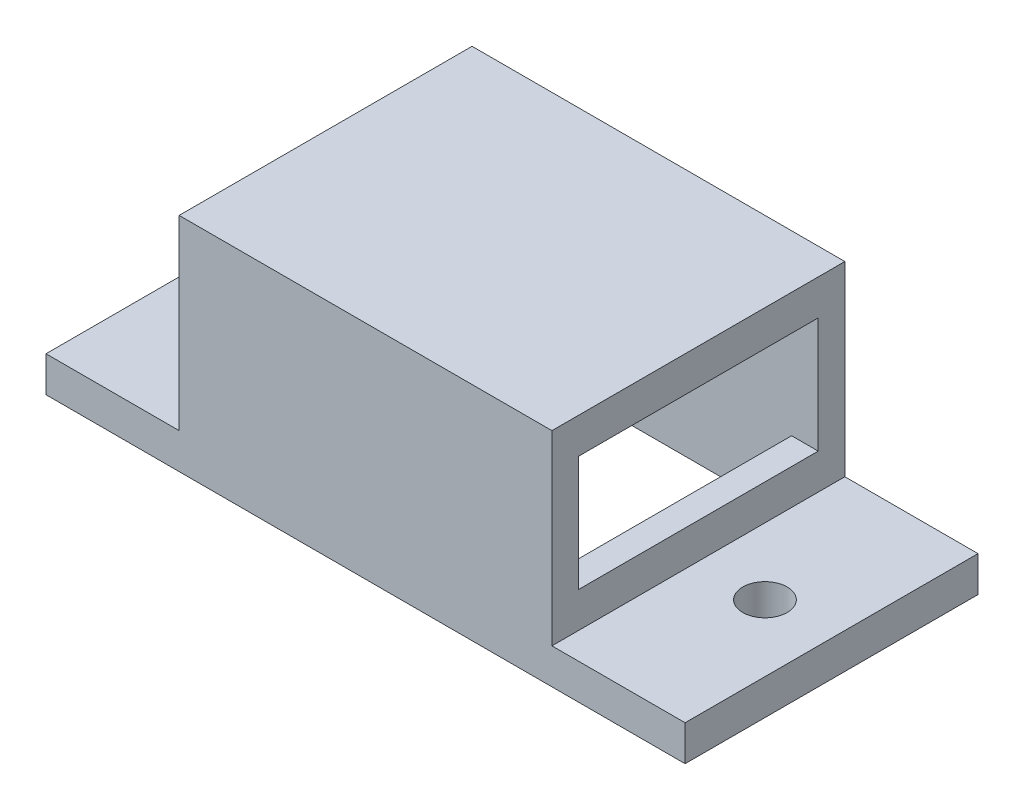
ISO-10303-21;
HEADER;
FILE_DESCRIPTION(('STEP AP214'),'2;1');
FILE_NAME('part.step','',(''),(''),'','','');
FILE_SCHEMA(('AUTOMOTIVE_DESIGN { 1 0 10303 214 1 1 1 1 }'));
ENDSEC;
DATA;
#1=APPLICATION_CONTEXT('core data for automotive mechanical design processes');
#2=APPLICATION_PROTOCOL_DEFINITION('international standard','automotive_design',2000,#1);
#3=PRODUCT_CONTEXT('',#1,'mechanical');
#4=PRODUCT('Part','Part','',(#3));
#5=PRODUCT_RELATED_PRODUCT_CATEGORY('part','',(#4));
#6=PRODUCT_DEFINITION_FORMATION('','',#4);
#7=PRODUCT_DEFINITION_CONTEXT('part definition',#1,'design');
#8=PRODUCT_DEFINITION('design','',#6,#7);
#9=PRODUCT_DEFINITION_SHAPE('','',#8);
#10=(LENGTH_UNIT() NAMED_UNIT(*) SI_UNIT(.MILLI.,.METRE.));
#11=(NAMED_UNIT(*) PLANE_ANGLE_UNIT() SI_UNIT($,.RADIAN.));
#12=(NAMED_UNIT(*) SI_UNIT($,.STERADIAN.) SOLID_ANGLE_UNIT());
#13=UNCERTAINTY_MEASURE_WITH_UNIT(LENGTH_MEASURE(1.E-05),#10,'distance_accuracy_value','');
#14=(GEOMETRIC_REPRESENTATION_CONTEXT(3) GLOBAL_UNCERTAINTY_ASSIGNED_CONTEXT((#13)) GLOBAL_UNIT_ASSIGNED_CONTEXT((#10,
#11,#12)) REPRESENTATION_CONTEXT('',''));
#15=CARTESIAN_POINT('',(0.,0.,0.));
#16=DIRECTION('',(0.,0.,1.));
#17=DIRECTION('',(1.,0.,0.));
#18=AXIS2_PLACEMENT_3D('',#15,#16,#17);
#19=CARTESIAN_POINT('',(0.,0.,0.));
#20=DIRECTION('',(0.,1.,0.));
#21=DIRECTION('',(0.,0.,1.));
#22=AXIS2_PLACEMENT_3D('',#19,#20,#21);
#23=PLANE('',#22);
#24=DIRECTION('',(-1.,0.,0.));
#25=VECTOR('',#24,1.);
#26=CARTESIAN_POINT('',(-21.,0.,-16.5));
#27=LINE('',#26,#25);
#28=CARTESIAN_POINT('',(36.,0.,-16.5));
#29=VERTEX_POINT('',#28);
#30=CARTESIAN_POINT('',(-36.,0.,-16.5));
#31=VERTEX_POINT('',#30);
#32=EDGE_CURVE('E250',#29,#31,#27,.T.);
#33=ORIENTED_EDGE('',*,*,#32,.F.);
#34=DIRECTION('',(0.,0.,-1.));
#35=VECTOR('',#34,1.);
#36=CARTESIAN_POINT('',(36.,0.,-16.5));
#37=LINE('',#36,#35);
#38=CARTESIAN_POINT('',(36.,0.,16.5));
#39=VERTEX_POINT('',#38);
#40=EDGE_CURVE('E211',#39,#29,#37,.T.);
#41=ORIENTED_EDGE('',*,*,#40,.F.);
#42=DIRECTION('',(1.,0.,0.));
#43=VECTOR('',#42,1.);
#44=CARTESIAN_POINT('',(-21.,0.,16.5));
#45=LINE('',#44,#43);
#46=CARTESIAN_POINT('',(-36.,0.,16.5));
#47=VERTEX_POINT('',#46);
#48=EDGE_CURVE('E255',#47,#39,#45,.T.);
#49=ORIENTED_EDGE('',*,*,#48,.F.);
#50=DIRECTION('',(0.,0.,1.));
#51=VECTOR('',#50,1.);
#52=CARTESIAN_POINT('',(-36.,0.,-16.5));
#53=LINE('',#52,#51);
#54=EDGE_CURVE('E220',#31,#47,#53,.T.);
#55=ORIENTED_EDGE('',*,*,#54,.F.);
#56=EDGE_LOOP('',(#33,#41,#49,#55));
#57=FACE_BOUND('',#56,.T.);
#58=DIRECTION('',(-1.,0.,0.));
#59=VECTOR('',#58,1.);
#60=CARTESIAN_POINT('',(-18.,0.,13.5));
#61=LINE('',#60,#59);
#62=CARTESIAN_POINT('',(18.,0.,13.5));
#63=VERTEX_POINT('',#62);
#64=CARTESIAN_POINT('',(-18.,0.,13.5));
#65=VERTEX_POINT('',#64);
#66=EDGE_CURVE('E202',#63,#65,#61,.T.);
#67=ORIENTED_EDGE('',*,*,#66,.F.);
#68=DIRECTION('',(0.,0.,1.));
#69=VECTOR('',#68,1.);
#70=CARTESIAN_POINT('',(18.,0.,13.5));
#71=LINE('',#70,#69);
#72=CARTESIAN_POINT('',(18.,0.,-13.5));
#73=VERTEX_POINT('',#72);
#74=EDGE_CURVE('E193',#73,#63,#71,.T.);
#75=ORIENTED_EDGE('',*,*,#74,.F.);
#76=DIRECTION('',(1.,0.,0.));
#77=VECTOR('',#76,1.);
#78=CARTESIAN_POINT('',(-18.,0.,-13.5));
#79=LINE('',#78,#77);
#80=CARTESIAN_POINT('',(-18.,0.,-13.5));
#81=VERTEX_POINT('',#80);
#82=EDGE_CURVE('E197',#81,#73,#79,.T.);
#83=ORIENTED_EDGE('',*,*,#82,.F.);
#84=DIRECTION('',(0.,0.,-1.));
#85=VECTOR('',#84,1.);
#86=CARTESIAN_POINT('',(-18.,0.,13.5));
#87=LINE('',#86,#85);
#88=EDGE_CURVE('E204',#65,#81,#87,.T.);
#89=ORIENTED_EDGE('',*,*,#88,.F.);
#90=EDGE_LOOP('',(#67,#75,#83,#89));
#91=FACE_BOUND('',#90,.T.);
#92=CARTESIAN_POINT('',(-28.5,0.,0.));
#93=DIRECTION('',(0.,1.,0.));
#94=DIRECTION('',(0.,0.,1.));
#95=AXIS2_PLACEMENT_3D('',#92,#93,#94);
#96=CIRCLE('',#95,2.5);
#97=CARTESIAN_POINT('',(-28.5,0.,2.5));
#98=VERTEX_POINT('',#97);
#99=EDGE_CURVE('E275',#98,#98,#96,.T.);
#100=ORIENTED_EDGE('',*,*,#99,.T.);
#101=EDGE_LOOP('',(#100));
#102=FACE_BOUND('',#101,.T.);
#103=CARTESIAN_POINT('',(28.5,0.,0.));
#104=DIRECTION('',(0.,-1.,0.));
#105=DIRECTION('',(0.,0.,-1.));
#106=AXIS2_PLACEMENT_3D('',#103,#104,#105);
#107=CIRCLE('',#106,2.5);
#108=CARTESIAN_POINT('',(28.5,0.,-2.5));
#109=VERTEX_POINT('',#108);
#110=EDGE_CURVE('E270',#109,#109,#107,.T.);
#111=ORIENTED_EDGE('',*,*,#110,.F.);
#112=EDGE_LOOP('',(#111));
#113=FACE_BOUND('',#112,.T.);
#114=ADVANCED_FACE('F33',(#57,#91,#102,#113),#23,.F.);
#115=CARTESIAN_POINT('',(21.,25.,-16.5));
#116=DIRECTION('',(-1.,0.,0.));
#117=DIRECTION('',(0.,0.,1.));
#118=AXIS2_PLACEMENT_3D('',#115,#116,#117);
#119=PLANE('',#118);
#120=DIRECTION('',(0.,0.,-1.));
#121=VECTOR('',#120,1.);
#122=CARTESIAN_POINT('',(21.,21.,-16.5));
#123=LINE('',#122,#121);
#124=CARTESIAN_POINT('',(21.,21.,13.5));
#125=VERTEX_POINT('',#124);
#126=CARTESIAN_POINT('',(21.,21.,-13.5));
#127=VERTEX_POINT('',#126);
#128=EDGE_CURVE('E190',#125,#127,#123,.T.);
#129=ORIENTED_EDGE('',*,*,#128,.T.);
#130=DIRECTION('',(0.,-1.,0.));
#131=VECTOR('',#130,1.);
#132=CARTESIAN_POINT('',(21.,25.,-13.5));
#133=LINE('',#132,#131);
#134=CARTESIAN_POINT('',(21.,8.,-13.5));
#135=VERTEX_POINT('',#134);
#136=EDGE_CURVE('E179',#127,#135,#133,.T.);
#137=ORIENTED_EDGE('',*,*,#136,.T.);
#138=DIRECTION('',(0.,0.,1.));
#139=VECTOR('',#138,1.);
#140=CARTESIAN_POINT('',(21.,8.,-16.5));
#141=LINE('',#140,#139);
#142=CARTESIAN_POINT('',(21.,8.,13.5));
#143=VERTEX_POINT('',#142);
#144=EDGE_CURVE('E187',#135,#143,#141,.T.);
#145=ORIENTED_EDGE('',*,*,#144,.T.);
#146=DIRECTION('',(0.,1.,0.));
#147=VECTOR('',#146,1.);
#148=CARTESIAN_POINT('',(21.,25.,13.5));
#149=LINE('',#148,#147);
#150=EDGE_CURVE('E176',#143,#125,#149,.T.);
#151=ORIENTED_EDGE('',*,*,#150,.T.);
#152=EDGE_LOOP('',(#129,#137,#145,#151));
#153=FACE_BOUND('',#152,.T.);
#154=DIRECTION('',(0.,-1.,0.));
#155=VECTOR('',#154,1.);
#156=CARTESIAN_POINT('',(21.,25.,16.5));
#157=LINE('',#156,#155);
#158=CARTESIAN_POINT('',(21.,25.,16.5));
#159=VERTEX_POINT('',#158);
#160=CARTESIAN_POINT('',(21.,4.,16.5));
#161=VERTEX_POINT('',#160);
#162=EDGE_CURVE('E261',#159,#161,#157,.T.);
#163=ORIENTED_EDGE('',*,*,#162,.T.);
#164=DIRECTION('',(0.,0.,-1.));
#165=VECTOR('',#164,1.);
#166=CARTESIAN_POINT('',(21.,4.,-16.5));
#167=LINE('',#166,#165);
#168=CARTESIAN_POINT('',(21.,4.,-16.5));
#169=VERTEX_POINT('',#168);
#170=EDGE_CURVE('E248',#161,#169,#167,.T.);
#171=ORIENTED_EDGE('',*,*,#170,.T.);
#172=DIRECTION('',(0.,-1.,0.));
#173=VECTOR('',#172,1.);
#174=CARTESIAN_POINT('',(21.,25.,-16.5));
#175=LINE('',#174,#173);
#176=CARTESIAN_POINT('',(21.,25.,-16.5));
#177=VERTEX_POINT('',#176);
#178=EDGE_CURVE('E11',#177,#169,#175,.T.);
#179=ORIENTED_EDGE('',*,*,#178,.F.);
#180=DIRECTION('',(0.,0.,-1.));
#181=VECTOR('',#180,1.);
#182=CARTESIAN_POINT('',(21.,25.,-16.5));
#183=LINE('',#182,#181);
#184=EDGE_CURVE('E251',#159,#177,#183,.T.);
#185=ORIENTED_EDGE('',*,*,#184,.F.);
#186=EDGE_LOOP('',(#163,#171,#179,#185));
#187=FACE_BOUND('',#186,.T.);
#188=ADVANCED_FACE('F35',(#153,#187),#119,.F.);
#189=CARTESIAN_POINT('',(-21.,25.,-16.5));
#190=DIRECTION('',(0.,0.,1.));
#191=DIRECTION('',(1.,0.,0.));
#192=AXIS2_PLACEMENT_3D('',#189,#190,#191);
#193=PLANE('',#192);
#194=ORIENTED_EDGE('',*,*,#178,.T.);
#195=DIRECTION('',(-1.,0.,0.));
#196=VECTOR('',#195,1.);
#197=CARTESIAN_POINT('',(-36.,4.,-16.5));
#198=LINE('',#197,#196);
#199=CARTESIAN_POINT('',(36.,4.,-16.5));
#200=VERTEX_POINT('',#199);
#201=EDGE_CURVE('E221',#200,#169,#198,.T.);
#202=ORIENTED_EDGE('',*,*,#201,.F.);
#203=DIRECTION('',(0.,-1.,0.));
#204=VECTOR('',#203,1.);
#205=CARTESIAN_POINT('',(36.,4.,-16.5));
#206=LINE('',#205,#204);
#207=EDGE_CURVE('E243',#200,#29,#206,.T.);
#208=ORIENTED_EDGE('',*,*,#207,.T.);
#209=ORIENTED_EDGE('',*,*,#32,.T.);
#210=DIRECTION('',(0.,-1.,0.));
#211=VECTOR('',#210,1.);
#212=CARTESIAN_POINT('',(-36.,4.,-16.5));
#213=LINE('',#212,#211);
#214=CARTESIAN_POINT('',(-36.,4.,-16.5));
#215=VERTEX_POINT('',#214);
#216=EDGE_CURVE('E240',#215,#31,#213,.T.);
#217=ORIENTED_EDGE('',*,*,#216,.F.);
#218=CARTESIAN_POINT('',(-21.,4.,-16.5));
#219=VERTEX_POINT('',#218);
#220=EDGE_CURVE('E219',#219,#215,#198,.T.);
#221=ORIENTED_EDGE('',*,*,#220,.F.);
#222=DIRECTION('',(0.,-1.,0.));
#223=VECTOR('',#222,1.);
#224=CARTESIAN_POINT('',(-21.,25.,-16.5));
#225=LINE('',#224,#223);
#226=CARTESIAN_POINT('',(-21.,25.,-16.5));
#227=VERTEX_POINT('',#226);
#228=EDGE_CURVE('E42',#227,#219,#225,.T.);
#229=ORIENTED_EDGE('',*,*,#228,.F.);
#230=DIRECTION('',(-1.,0.,0.));
#231=VECTOR('',#230,1.);
#232=CARTESIAN_POINT('',(-21.,25.,-16.5));
#233=LINE('',#232,#231);
#234=EDGE_CURVE('E254',#177,#227,#233,.T.);
#235=ORIENTED_EDGE('',*,*,#234,.F.);
#236=EDGE_LOOP('',(#194,#202,#208,#209,#217,#221,#229,#235));
#237=FACE_BOUND('',#236,.T.);
#238=ADVANCED_FACE('F303',(#237),#193,.F.);
#239=CARTESIAN_POINT('',(-21.,25.,-16.5));
#240=DIRECTION('',(1.,0.,0.));
#241=DIRECTION('',(0.,0.,-1.));
#242=AXIS2_PLACEMENT_3D('',#239,#240,#241);
#243=PLANE('',#242);
#244=DIRECTION('',(0.,0.,1.));
#245=VECTOR('',#244,1.);
#246=CARTESIAN_POINT('',(-21.,8.,13.5));
#247=LINE('',#246,#245);
#248=CARTESIAN_POINT('',(-21.,8.,-13.5));
#249=VERTEX_POINT('',#248);
#250=CARTESIAN_POINT('',(-21.,8.,13.5));
#251=VERTEX_POINT('',#250);
#252=EDGE_CURVE('E162',#249,#251,#247,.T.);
#253=ORIENTED_EDGE('',*,*,#252,.F.);
#254=DIRECTION('',(0.,-1.,0.));
#255=VECTOR('',#254,1.);
#256=CARTESIAN_POINT('',(-21.,8.,-13.5));
#257=LINE('',#256,#255);
#258=CARTESIAN_POINT('',(-21.,21.,-13.5));
#259=VERTEX_POINT('',#258);
#260=EDGE_CURVE('E58',#259,#249,#257,.T.);
#261=ORIENTED_EDGE('',*,*,#260,.F.);
#262=DIRECTION('',(0.,0.,-1.));
#263=VECTOR('',#262,1.);
#264=CARTESIAN_POINT('',(-21.,21.,13.5));
#265=LINE('',#264,#263);
#266=CARTESIAN_POINT('',(-21.,21.,13.5));
#267=VERTEX_POINT('',#266);
#268=EDGE_CURVE('E170',#267,#259,#265,.T.);
#269=ORIENTED_EDGE('',*,*,#268,.F.);
#270=DIRECTION('',(0.,1.,0.));
#271=VECTOR('',#270,1.);
#272=CARTESIAN_POINT('',(-21.,8.,13.5));
#273=LINE('',#272,#271);
#274=EDGE_CURVE('E153',#251,#267,#273,.T.);
#275=ORIENTED_EDGE('',*,*,#274,.F.);
#276=EDGE_LOOP('',(#253,#261,#269,#275));
#277=FACE_BOUND('',#276,.T.);
#278=ORIENTED_EDGE('',*,*,#228,.T.);
#279=DIRECTION('',(0.,0.,1.));
#280=VECTOR('',#279,1.);
#281=CARTESIAN_POINT('',(-21.,4.,-16.5));
#282=LINE('',#281,#280);
#283=CARTESIAN_POINT('',(-21.,4.,16.5));
#284=VERTEX_POINT('',#283);
#285=EDGE_CURVE('E246',#219,#284,#282,.T.);
#286=ORIENTED_EDGE('',*,*,#285,.T.);
#287=DIRECTION('',(0.,-1.,0.));
#288=VECTOR('',#287,1.);
#289=CARTESIAN_POINT('',(-21.,25.,16.5));
#290=LINE('',#289,#288);
#291=CARTESIAN_POINT('',(-21.,25.,16.5));
#292=VERTEX_POINT('',#291);
#293=EDGE_CURVE('E265',#292,#284,#290,.T.);
#294=ORIENTED_EDGE('',*,*,#293,.F.);
#295=DIRECTION('',(0.,0.,1.));
#296=VECTOR('',#295,1.);
#297=CARTESIAN_POINT('',(-21.,25.,-16.5));
#298=LINE('',#297,#296);
#299=EDGE_CURVE('E257',#227,#292,#298,.T.);
#300=ORIENTED_EDGE('',*,*,#299,.F.);
#301=EDGE_LOOP('',(#278,#286,#294,#300));
#302=FACE_BOUND('',#301,.T.);
#303=ADVANCED_FACE('F167',(#277,#302),#243,.F.);
#304=CARTESIAN_POINT('',(-21.,25.,16.5));
#305=DIRECTION('',(0.,0.,-1.));
#306=DIRECTION('',(-1.,0.,0.));
#307=AXIS2_PLACEMENT_3D('',#304,#305,#306);
#308=PLANE('',#307);
#309=ORIENTED_EDGE('',*,*,#293,.T.);
#310=DIRECTION('',(1.,0.,0.));
#311=VECTOR('',#310,1.);
#312=CARTESIAN_POINT('',(-36.,4.,16.5));
#313=LINE('',#312,#311);
#314=CARTESIAN_POINT('',(-36.,4.,16.5));
#315=VERTEX_POINT('',#314);
#316=EDGE_CURVE('E227',#315,#284,#313,.T.);
#317=ORIENTED_EDGE('',*,*,#316,.F.);
#318=DIRECTION('',(0.,-1.,0.));
#319=VECTOR('',#318,1.);
#320=CARTESIAN_POINT('',(-36.,4.,16.5));
#321=LINE('',#320,#319);
#322=EDGE_CURVE('E237',#315,#47,#321,.T.);
#323=ORIENTED_EDGE('',*,*,#322,.T.);
#324=ORIENTED_EDGE('',*,*,#48,.T.);
#325=DIRECTION('',(0.,-1.,0.));
#326=VECTOR('',#325,1.);
#327=CARTESIAN_POINT('',(36.,4.,16.5));
#328=LINE('',#327,#326);
#329=CARTESIAN_POINT('',(36.,4.,16.5));
#330=VERTEX_POINT('',#329);
#331=EDGE_CURVE('E230',#330,#39,#328,.T.);
#332=ORIENTED_EDGE('',*,*,#331,.F.);
#333=EDGE_CURVE('E226',#161,#330,#313,.T.);
#334=ORIENTED_EDGE('',*,*,#333,.F.);
#335=ORIENTED_EDGE('',*,*,#162,.F.);
#336=DIRECTION('',(1.,0.,0.));
#337=VECTOR('',#336,1.);
#338=CARTESIAN_POINT('',(-21.,25.,16.5));
#339=LINE('',#338,#337);
#340=EDGE_CURVE('E259',#292,#159,#339,.T.);
#341=ORIENTED_EDGE('',*,*,#340,.F.);
#342=EDGE_LOOP('',(#309,#317,#323,#324,#332,#334,#335,#341));
#343=FACE_BOUND('',#342,.T.);
#344=ADVANCED_FACE('F310',(#343),#308,.F.);
#345=CARTESIAN_POINT('',(0.,25.,0.));
#346=DIRECTION('',(0.,1.,0.));
#347=DIRECTION('',(0.,0.,1.));
#348=AXIS2_PLACEMENT_3D('',#345,#346,#347);
#349=PLANE('',#348);
#350=ORIENTED_EDGE('',*,*,#184,.T.);
#351=ORIENTED_EDGE('',*,*,#234,.T.);
#352=ORIENTED_EDGE('',*,*,#299,.T.);
#353=ORIENTED_EDGE('',*,*,#340,.T.);
#354=EDGE_LOOP('',(#350,#351,#352,#353));
#355=FACE_BOUND('',#354,.T.);
#356=ADVANCED_FACE('F308',(#355),#349,.T.);
#357=CARTESIAN_POINT('',(-36.,4.,-16.5));
#358=DIRECTION('',(1.,0.,0.));
#359=DIRECTION('',(0.,0.,-1.));
#360=AXIS2_PLACEMENT_3D('',#357,#358,#359);
#361=PLANE('',#360);
#362=ORIENTED_EDGE('',*,*,#54,.T.);
#363=ORIENTED_EDGE('',*,*,#322,.F.);
#364=DIRECTION('',(0.,0.,1.));
#365=VECTOR('',#364,1.);
#366=CARTESIAN_POINT('',(-36.,4.,-16.5));
#367=LINE('',#366,#365);
#368=EDGE_CURVE('E224',#215,#315,#367,.T.);
#369=ORIENTED_EDGE('',*,*,#368,.F.);
#370=ORIENTED_EDGE('',*,*,#216,.T.);
#371=EDGE_LOOP('',(#362,#363,#369,#370));
#372=FACE_BOUND('',#371,.T.);
#373=ADVANCED_FACE('F338',(#372),#361,.F.);
#374=CARTESIAN_POINT('',(0.,4.,0.));
#375=DIRECTION('',(0.,1.,0.));
#376=DIRECTION('',(0.,0.,1.));
#377=AXIS2_PLACEMENT_3D('',#374,#375,#376);
#378=PLANE('',#377);
#379=CARTESIAN_POINT('',(-28.5,4.,0.));
#380=DIRECTION('',(0.,1.,0.));
#381=DIRECTION('',(0.,0.,1.));
#382=AXIS2_PLACEMENT_3D('',#379,#380,#381);
#383=CIRCLE('',#382,2.5);
#384=CARTESIAN_POINT('',(-28.5,4.,2.5));
#385=VERTEX_POINT('',#384);
#386=EDGE_CURVE('E37',#385,#385,#383,.F.);
#387=ORIENTED_EDGE('',*,*,#386,.T.);
#388=EDGE_LOOP('',(#387));
#389=FACE_BOUND('',#388,.T.);
#390=ORIENTED_EDGE('',*,*,#285,.F.);
#391=ORIENTED_EDGE('',*,*,#220,.T.);
#392=ORIENTED_EDGE('',*,*,#368,.T.);
#393=ORIENTED_EDGE('',*,*,#316,.T.);
#394=EDGE_LOOP('',(#390,#391,#392,#393));
#395=FACE_BOUND('',#394,.T.);
#396=ADVANCED_FACE('F345',(#389,#395),#378,.T.);
#397=CARTESIAN_POINT('',(28.5,4.,0.));
#398=DIRECTION('',(0.,1.,0.));
#399=DIRECTION('',(0.,0.,1.));
#400=AXIS2_PLACEMENT_3D('',#397,#398,#399);
#401=CIRCLE('',#400,2.5);
#402=CARTESIAN_POINT('',(28.5,4.,2.5));
#403=VERTEX_POINT('',#402);
#404=EDGE_CURVE('E268',#403,#403,#401,.T.);
#405=ORIENTED_EDGE('',*,*,#404,.F.);
#406=EDGE_LOOP('',(#405));
#407=FACE_BOUND('',#406,.T.);
#408=ORIENTED_EDGE('',*,*,#170,.F.);
#409=ORIENTED_EDGE('',*,*,#333,.T.);
#410=DIRECTION('',(0.,0.,-1.));
#411=VECTOR('',#410,1.);
#412=CARTESIAN_POINT('',(36.,4.,-16.5));
#413=LINE('',#412,#411);
#414=EDGE_CURVE('E216',#330,#200,#413,.T.);
#415=ORIENTED_EDGE('',*,*,#414,.T.);
#416=ORIENTED_EDGE('',*,*,#201,.T.);
#417=EDGE_LOOP('',(#408,#409,#415,#416));
#418=FACE_BOUND('',#417,.T.);
#419=ADVANCED_FACE('F325',(#407,#418),#378,.T.);
#420=CARTESIAN_POINT('',(36.,4.,-16.5));
#421=DIRECTION('',(-1.,0.,0.));
#422=DIRECTION('',(0.,0.,1.));
#423=AXIS2_PLACEMENT_3D('',#420,#421,#422);
#424=PLANE('',#423);
#425=ORIENTED_EDGE('',*,*,#40,.T.);
#426=ORIENTED_EDGE('',*,*,#207,.F.);
#427=ORIENTED_EDGE('',*,*,#414,.F.);
#428=ORIENTED_EDGE('',*,*,#331,.T.);
#429=EDGE_LOOP('',(#425,#426,#427,#428));
#430=FACE_BOUND('',#429,.T.);
#431=ADVANCED_FACE('F331',(#430),#424,.F.);
#432=CARTESIAN_POINT('',(18.,21.,13.5));
#433=DIRECTION('',(1.,0.,0.));
#434=DIRECTION('',(0.,0.,-1.));
#435=AXIS2_PLACEMENT_3D('',#432,#433,#434);
#436=PLANE('',#435);
#437=DIRECTION('',(0.,-1.,0.));
#438=VECTOR('',#437,1.);
#439=CARTESIAN_POINT('',(18.,21.,13.5));
#440=LINE('',#439,#438);
#441=CARTESIAN_POINT('',(18.,8.,13.5));
#442=VERTEX_POINT('',#441);
#443=EDGE_CURVE('E199',#442,#63,#440,.T.);
#444=ORIENTED_EDGE('',*,*,#443,.F.);
#445=DIRECTION('',(0.,0.,-1.));
#446=VECTOR('',#445,1.);
#447=CARTESIAN_POINT('',(18.,8.,13.5));
#448=LINE('',#447,#446);
#449=CARTESIAN_POINT('',(18.,8.,-13.5));
#450=VERTEX_POINT('',#449);
#451=EDGE_CURVE('E184',#442,#450,#448,.T.);
#452=ORIENTED_EDGE('',*,*,#451,.T.);
#453=DIRECTION('',(0.,-1.,0.));
#454=VECTOR('',#453,1.);
#455=CARTESIAN_POINT('',(18.,21.,-13.5));
#456=LINE('',#455,#454);
#457=EDGE_CURVE('E209',#450,#73,#456,.T.);
#458=ORIENTED_EDGE('',*,*,#457,.T.);
#459=ORIENTED_EDGE('',*,*,#74,.T.);
#460=EDGE_LOOP('',(#444,#452,#458,#459));
#461=FACE_BOUND('',#460,.T.);
#462=ADVANCED_FACE('F361',(#461),#436,.F.);
#463=CARTESIAN_POINT('',(-18.,21.,-13.5));
#464=DIRECTION('',(0.,0.,-1.));
#465=DIRECTION('',(-1.,0.,0.));
#466=AXIS2_PLACEMENT_3D('',#463,#464,#465);
#467=PLANE('',#466);
#468=ORIENTED_EDGE('',*,*,#457,.F.);
#469=DIRECTION('',(-1.,0.,0.));
#470=VECTOR('',#469,1.);
#471=CARTESIAN_POINT('',(36.,8.,-13.5));
#472=LINE('',#471,#470);
#473=EDGE_CURVE('E159',#135,#450,#472,.T.);
#474=ORIENTED_EDGE('',*,*,#473,.F.);
#475=ORIENTED_EDGE('',*,*,#136,.F.);
#476=DIRECTION('',(1.,0.,0.));
#477=VECTOR('',#476,1.);
#478=CARTESIAN_POINT('',(-18.,21.,-13.5));
#479=LINE('',#478,#477);
#480=EDGE_CURVE('E196',#259,#127,#479,.T.);
#481=ORIENTED_EDGE('',*,*,#480,.F.);
#482=ORIENTED_EDGE('',*,*,#260,.T.);
#483=CARTESIAN_POINT('',(-18.,8.,-13.5));
#484=VERTEX_POINT('',#483);
#485=EDGE_CURVE('E164',#484,#249,#472,.T.);
#486=ORIENTED_EDGE('',*,*,#485,.F.);
#487=DIRECTION('',(0.,-1.,0.));
#488=VECTOR('',#487,1.);
#489=CARTESIAN_POINT('',(-18.,21.,-13.5));
#490=LINE('',#489,#488);
#491=EDGE_CURVE('E212',#484,#81,#490,.T.);
#492=ORIENTED_EDGE('',*,*,#491,.T.);
#493=ORIENTED_EDGE('',*,*,#82,.T.);
#494=EDGE_LOOP('',(#468,#474,#475,#481,#482,#486,#492,#493));
#495=FACE_BOUND('',#494,.T.);
#496=ADVANCED_FACE('F366',(#495),#467,.F.);
#497=CARTESIAN_POINT('',(-18.,21.,13.5));
#498=DIRECTION('',(-1.,0.,0.));
#499=DIRECTION('',(0.,0.,1.));
#500=AXIS2_PLACEMENT_3D('',#497,#498,#499);
#501=PLANE('',#500);
#502=ORIENTED_EDGE('',*,*,#491,.F.);
#503=DIRECTION('',(0.,0.,1.));
#504=VECTOR('',#503,1.);
#505=CARTESIAN_POINT('',(-18.,8.,13.5));
#506=LINE('',#505,#504);
#507=CARTESIAN_POINT('',(-18.,8.,13.5));
#508=VERTEX_POINT('',#507);
#509=EDGE_CURVE('E182',#484,#508,#506,.T.);
#510=ORIENTED_EDGE('',*,*,#509,.T.);
#511=DIRECTION('',(0.,-1.,0.));
#512=VECTOR('',#511,1.);
#513=CARTESIAN_POINT('',(-18.,21.,13.5));
#514=LINE('',#513,#512);
#515=EDGE_CURVE('E156',#508,#65,#514,.T.);
#516=ORIENTED_EDGE('',*,*,#515,.T.);
#517=ORIENTED_EDGE('',*,*,#88,.T.);
#518=EDGE_LOOP('',(#502,#510,#516,#517));
#519=FACE_BOUND('',#518,.T.);
#520=ADVANCED_FACE('F417',(#519),#501,.F.);
#521=CARTESIAN_POINT('',(-18.,21.,13.5));
#522=DIRECTION('',(0.,0.,1.));
#523=DIRECTION('',(1.,0.,0.));
#524=AXIS2_PLACEMENT_3D('',#521,#522,#523);
#525=PLANE('',#524);
#526=ORIENTED_EDGE('',*,*,#515,.F.);
#527=DIRECTION('',(-1.,0.,0.));
#528=VECTOR('',#527,1.);
#529=CARTESIAN_POINT('',(36.,8.,13.5));
#530=LINE('',#529,#528);
#531=EDGE_CURVE('E149',#508,#251,#530,.T.);
#532=ORIENTED_EDGE('',*,*,#531,.T.);
#533=ORIENTED_EDGE('',*,*,#274,.T.);
#534=DIRECTION('',(-1.,0.,0.));
#535=VECTOR('',#534,1.);
#536=CARTESIAN_POINT('',(-18.,21.,13.5));
#537=LINE('',#536,#535);
#538=EDGE_CURVE('E194',#125,#267,#537,.T.);
#539=ORIENTED_EDGE('',*,*,#538,.F.);
#540=ORIENTED_EDGE('',*,*,#150,.F.);
#541=EDGE_CURVE('E50',#143,#442,#530,.T.);
#542=ORIENTED_EDGE('',*,*,#541,.T.);
#543=ORIENTED_EDGE('',*,*,#443,.T.);
#544=ORIENTED_EDGE('',*,*,#66,.T.);
#545=EDGE_LOOP('',(#526,#532,#533,#539,#540,#542,#543,#544));
#546=FACE_BOUND('',#545,.T.);
#547=ADVANCED_FACE('F151',(#546),#525,.F.);
#548=CARTESIAN_POINT('',(0.,21.,0.));
#549=DIRECTION('',(0.,-1.,0.));
#550=DIRECTION('',(0.,0.,-1.));
#551=AXIS2_PLACEMENT_3D('',#548,#549,#550);
#552=PLANE('',#551);
#553=ORIENTED_EDGE('',*,*,#480,.T.);
#554=ORIENTED_EDGE('',*,*,#128,.F.);
#555=ORIENTED_EDGE('',*,*,#538,.T.);
#556=ORIENTED_EDGE('',*,*,#268,.T.);
#557=EDGE_LOOP('',(#553,#554,#555,#556));
#558=FACE_BOUND('',#557,.T.);
#559=ADVANCED_FACE('F399',(#558),#552,.T.);
#560=CARTESIAN_POINT('',(36.,8.,13.5));
#561=DIRECTION('',(0.,-1.,0.));
#562=DIRECTION('',(0.,0.,-1.));
#563=AXIS2_PLACEMENT_3D('',#560,#561,#562);
#564=PLANE('',#563);
#565=ORIENTED_EDGE('',*,*,#485,.T.);
#566=ORIENTED_EDGE('',*,*,#252,.T.);
#567=ORIENTED_EDGE('',*,*,#531,.F.);
#568=ORIENTED_EDGE('',*,*,#509,.F.);
#569=EDGE_LOOP('',(#565,#566,#567,#568));
#570=FACE_BOUND('',#569,.T.);
#571=ADVANCED_FACE('F163',(#570),#564,.F.);
#572=ORIENTED_EDGE('',*,*,#473,.T.);
#573=ORIENTED_EDGE('',*,*,#451,.F.);
#574=ORIENTED_EDGE('',*,*,#541,.F.);
#575=ORIENTED_EDGE('',*,*,#144,.F.);
#576=EDGE_LOOP('',(#572,#573,#574,#575));
#577=FACE_BOUND('',#576,.T.);
#578=ADVANCED_FACE('F293',(#577),#564,.F.);
#579=CARTESIAN_POINT('',(28.5,25.,0.));
#580=DIRECTION('',(0.,-1.,0.));
#581=DIRECTION('',(0.,0.,-1.));
#582=AXIS2_PLACEMENT_3D('',#579,#580,#581);
#583=CYLINDRICAL_SURFACE('',#582,2.5);
#584=ORIENTED_EDGE('',*,*,#404,.T.);
#585=EDGE_LOOP('',(#584));
#586=FACE_BOUND('',#585,.T.);
#587=ORIENTED_EDGE('',*,*,#110,.T.);
#588=EDGE_LOOP('',(#587));
#589=FACE_BOUND('',#588,.T.);
#590=ADVANCED_FACE('F287',(#586,#589),#583,.F.);
#591=CARTESIAN_POINT('',(-28.5,25.,0.));
#592=DIRECTION('',(0.,-1.,0.));
#593=DIRECTION('',(0.,0.,-1.));
#594=AXIS2_PLACEMENT_3D('',#591,#592,#593);
#595=CYLINDRICAL_SURFACE('',#594,2.5);
#596=ORIENTED_EDGE('',*,*,#386,.F.);
#597=EDGE_LOOP('',(#596));
#598=FACE_BOUND('',#597,.T.);
#599=ORIENTED_EDGE('',*,*,#99,.F.);
#600=EDGE_LOOP('',(#599));
#601=FACE_BOUND('',#600,.T.);
#602=ADVANCED_FACE('F285',(#598,#601),#595,.F.);
#603=CLOSED_SHELL('',(#114,#188,#238,#303,#344,#356,#373,#396,#419,#431,#462,#496,#520,#547,
#559,#571,#578,#590,#602));
#604=MANIFOLD_SOLID_BREP('B2',#603);
#605=ADVANCED_BREP_SHAPE_REPRESENTATION('',(#18,#604),#14);
#606=SHAPE_DEFINITION_REPRESENTATION(#9,#605);
ENDSEC;
END-ISO-10303-21;
